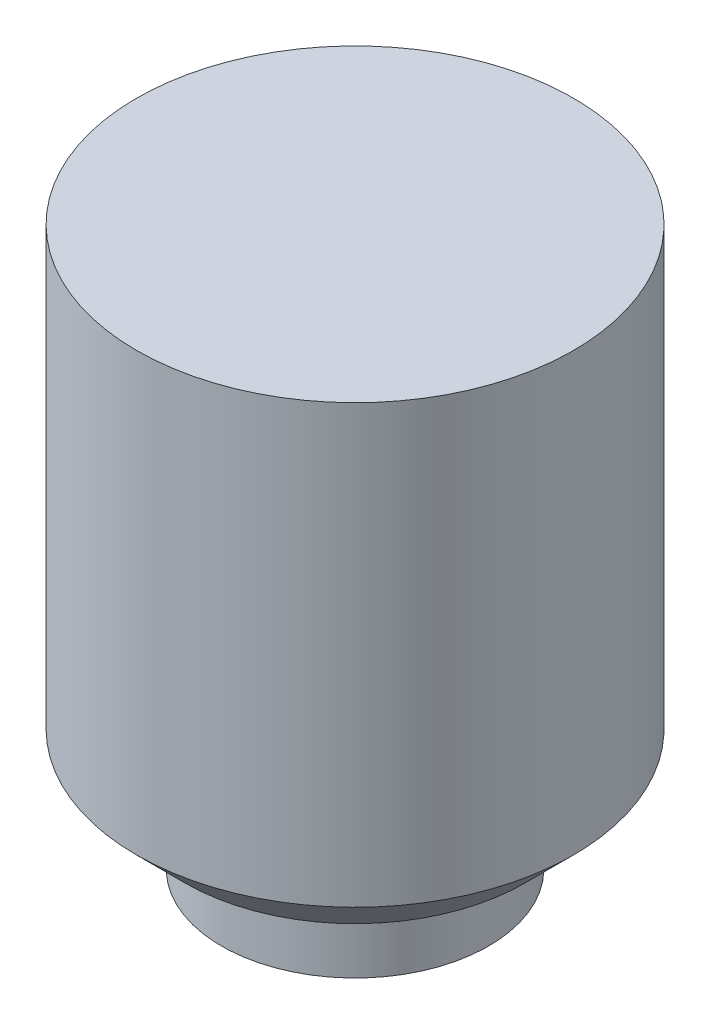
ISO-10303-21;
HEADER;
FILE_DESCRIPTION(('STEP AP214'),'2;1');
FILE_NAME('part.step','',(''),(''),'','','');
FILE_SCHEMA(('AUTOMOTIVE_DESIGN { 1 0 10303 214 1 1 1 1 }'));
ENDSEC;
DATA;
#1=APPLICATION_CONTEXT('core data for automotive mechanical design processes');
#2=APPLICATION_PROTOCOL_DEFINITION('international standard','automotive_design',2000,#1);
#3=PRODUCT_CONTEXT('',#1,'mechanical');
#4=PRODUCT('Part','Part','',(#3));
#5=PRODUCT_RELATED_PRODUCT_CATEGORY('part','',(#4));
#6=PRODUCT_DEFINITION_FORMATION('','',#4);
#7=PRODUCT_DEFINITION_CONTEXT('part definition',#1,'design');
#8=PRODUCT_DEFINITION('design','',#6,#7);
#9=PRODUCT_DEFINITION_SHAPE('','',#8);
#10=(LENGTH_UNIT() NAMED_UNIT(*) SI_UNIT(.MILLI.,.METRE.));
#11=(NAMED_UNIT(*) PLANE_ANGLE_UNIT() SI_UNIT($,.RADIAN.));
#12=(NAMED_UNIT(*) SI_UNIT($,.STERADIAN.) SOLID_ANGLE_UNIT());
#13=UNCERTAINTY_MEASURE_WITH_UNIT(LENGTH_MEASURE(1.E-05),#10,'distance_accuracy_value','');
#14=(GEOMETRIC_REPRESENTATION_CONTEXT(3) GLOBAL_UNCERTAINTY_ASSIGNED_CONTEXT((#13)) GLOBAL_UNIT_ASSIGNED_CONTEXT((#10,
#11,#12)) REPRESENTATION_CONTEXT('',''));
#15=CARTESIAN_POINT('',(0.,0.,0.));
#16=DIRECTION('',(0.,0.,1.));
#17=DIRECTION('',(1.,0.,0.));
#18=AXIS2_PLACEMENT_3D('',#15,#16,#17);
#19=CARTESIAN_POINT('',(0.,10.,0.));
#20=DIRECTION('',(0.,-1.,0.));
#21=DIRECTION('',(0.,0.,-1.));
#22=AXIS2_PLACEMENT_3D('',#19,#20,#21);
#23=CYLINDRICAL_SURFACE('',#22,4.5);
#24=CARTESIAN_POINT('',(0.,0.999999999999999,0.));
#25=DIRECTION('',(0.,1.,0.));
#26=DIRECTION('',(0.,0.,1.));
#27=AXIS2_PLACEMENT_3D('',#24,#25,#26);
#28=CIRCLE('',#27,4.5);
#29=CARTESIAN_POINT('',(0.,0.999999999999999,4.5));
#30=VERTEX_POINT('',#29);
#31=EDGE_CURVE('E47',#30,#30,#28,.T.);
#32=ORIENTED_EDGE('',*,*,#31,.T.);
#33=EDGE_LOOP('',(#32));
#34=FACE_BOUND('',#33,.T.);
#35=CARTESIAN_POINT('',(0.,10.,0.));
#36=DIRECTION('',(0.,1.,0.));
#37=DIRECTION('',(0.,0.,1.));
#38=AXIS2_PLACEMENT_3D('',#35,#36,#37);
#39=CIRCLE('',#38,4.5);
#40=CARTESIAN_POINT('',(0.,10.,4.5));
#41=VERTEX_POINT('',#40);
#42=EDGE_CURVE('E70',#41,#41,#39,.T.);
#43=ORIENTED_EDGE('',*,*,#42,.F.);
#44=EDGE_LOOP('',(#43));
#45=FACE_BOUND('',#44,.T.);
#46=ADVANCED_FACE('F39',(#34,#45),#23,.T.);
#47=CARTESIAN_POINT('',(0.,10.,0.));
#48=DIRECTION('',(0.,1.,0.));
#49=DIRECTION('',(0.,0.,1.));
#50=AXIS2_PLACEMENT_3D('',#47,#48,#49);
#51=PLANE('',#50);
#52=ORIENTED_EDGE('',*,*,#42,.T.);
#53=EDGE_LOOP('',(#52));
#54=FACE_BOUND('',#53,.T.);
#55=ADVANCED_FACE('F116',(#54),#51,.T.);
#56=CARTESIAN_POINT('',(0.,0.,0.));
#57=DIRECTION('',(0.,1.,0.));
#58=DIRECTION('',(0.,0.,1.));
#59=AXIS2_PLACEMENT_3D('',#56,#57,#58);
#60=PLANE('',#59);
#61=CARTESIAN_POINT('',(0.,0.,0.));
#62=DIRECTION('',(0.,1.,0.));
#63=DIRECTION('',(0.,0.,1.));
#64=AXIS2_PLACEMENT_3D('',#61,#62,#63);
#65=CIRCLE('',#64,3.5);
#66=CARTESIAN_POINT('',(0.,0.,3.5));
#67=VERTEX_POINT('',#66);
#68=EDGE_CURVE('E11',#67,#67,#65,.F.);
#69=ORIENTED_EDGE('',*,*,#68,.T.);
#70=EDGE_LOOP('',(#69));
#71=FACE_BOUND('',#70,.T.);
#72=CARTESIAN_POINT('',(0.,0.,0.));
#73=DIRECTION('',(0.,-1.,0.));
#74=DIRECTION('',(0.,0.,-1.));
#75=AXIS2_PLACEMENT_3D('',#72,#73,#74);
#76=CIRCLE('',#75,2.75);
#77=CARTESIAN_POINT('',(0.,0.,-2.75));
#78=VERTEX_POINT('',#77);
#79=EDGE_CURVE('E91',#78,#78,#76,.T.);
#80=ORIENTED_EDGE('',*,*,#79,.F.);
#81=EDGE_LOOP('',(#80));
#82=FACE_BOUND('',#81,.T.);
#83=ADVANCED_FACE('F120',(#71,#82),#60,.F.);
#84=CARTESIAN_POINT('',(0.,-1.5,0.));
#85=DIRECTION('',(0.,-1.,0.));
#86=DIRECTION('',(0.,0.,-1.));
#87=AXIS2_PLACEMENT_3D('',#84,#85,#86);
#88=PLANE('',#87);
#89=CARTESIAN_POINT('',(0.,-1.5,0.));
#90=DIRECTION('',(0.,-1.,0.));
#91=DIRECTION('',(0.,0.,-1.));
#92=AXIS2_PLACEMENT_3D('',#89,#90,#91);
#93=CIRCLE('',#92,2.75);
#94=CARTESIAN_POINT('',(0.,-1.5,-2.75));
#95=VERTEX_POINT('',#94);
#96=EDGE_CURVE('E80',#95,#95,#93,.T.);
#97=ORIENTED_EDGE('',*,*,#96,.T.);
#98=EDGE_LOOP('',(#97));
#99=FACE_BOUND('',#98,.T.);
#100=CARTESIAN_POINT('',(0.,-1.5,0.));
#101=DIRECTION('',(0.,-1.,0.));
#102=DIRECTION('',(0.,0.,-1.));
#103=AXIS2_PLACEMENT_3D('',#100,#101,#102);
#104=CIRCLE('',#103,1.75);
#105=CARTESIAN_POINT('',(0.,-1.5,-1.75));
#106=VERTEX_POINT('',#105);
#107=EDGE_CURVE('E83',#106,#106,#104,.T.);
#108=ORIENTED_EDGE('',*,*,#107,.F.);
#109=EDGE_LOOP('',(#108));
#110=FACE_BOUND('',#109,.T.);
#111=ADVANCED_FACE('F126',(#99,#110),#88,.T.);
#112=CARTESIAN_POINT('',(0.,-1.5,0.));
#113=DIRECTION('',(0.,1.,0.));
#114=DIRECTION('',(0.,0.,1.));
#115=AXIS2_PLACEMENT_3D('',#112,#113,#114);
#116=CYLINDRICAL_SURFACE('',#115,2.75);
#117=ORIENTED_EDGE('',*,*,#96,.F.);
#118=EDGE_LOOP('',(#117));
#119=FACE_BOUND('',#118,.T.);
#120=ORIENTED_EDGE('',*,*,#79,.T.);
#121=EDGE_LOOP('',(#120));
#122=FACE_BOUND('',#121,.T.);
#123=ADVANCED_FACE('F110',(#119,#122),#116,.T.);
#124=CARTESIAN_POINT('',(0.,-1.5,0.));
#125=DIRECTION('',(0.,1.,0.));
#126=DIRECTION('',(0.,0.,1.));
#127=AXIS2_PLACEMENT_3D('',#124,#125,#126);
#128=CYLINDRICAL_SURFACE('',#127,1.75);
#129=ORIENTED_EDGE('',*,*,#107,.T.);
#130=EDGE_LOOP('',(#129));
#131=FACE_BOUND('',#130,.T.);
#132=CARTESIAN_POINT('',(0.,0.,0.));
#133=DIRECTION('',(0.,-1.,0.));
#134=DIRECTION('',(0.,0.,-1.));
#135=AXIS2_PLACEMENT_3D('',#132,#133,#134);
#136=CIRCLE('',#135,1.75);
#137=CARTESIAN_POINT('',(0.,0.,-1.75));
#138=VERTEX_POINT('',#137);
#139=EDGE_CURVE('E217',#138,#138,#136,.T.);
#140=ORIENTED_EDGE('',*,*,#139,.F.);
#141=EDGE_LOOP('',(#140));
#142=FACE_BOUND('',#141,.T.);
#143=ADVANCED_FACE('F103',(#131,#142),#128,.F.);
#144=CARTESIAN_POINT('',(0.,3.,0.));
#145=DIRECTION('',(0.,-1.,0.));
#146=DIRECTION('',(0.,0.,-1.));
#147=AXIS2_PLACEMENT_3D('',#144,#145,#146);
#148=PLANE('',#147);
#149=CARTESIAN_POINT('',(0.,3.,0.));
#150=DIRECTION('',(0.,-1.,0.));
#151=DIRECTION('',(0.,0.,-1.));
#152=AXIS2_PLACEMENT_3D('',#149,#150,#151);
#153=CIRCLE('',#152,1.45);
#154=CARTESIAN_POINT('',(-1.,3.,1.05));
#155=VERTEX_POINT('',#154);
#156=CARTESIAN_POINT('',(1.,3.,1.05));
#157=VERTEX_POINT('',#156);
#158=EDGE_CURVE('E68',#155,#157,#153,.T.);
#159=ORIENTED_EDGE('',*,*,#158,.T.);
#160=DIRECTION('',(-1.,0.,0.));
#161=VECTOR('',#160,1.);
#162=CARTESIAN_POINT('',(-1.,3.,1.05));
#163=LINE('',#162,#161);
#164=EDGE_CURVE('E86',#157,#155,#163,.T.);
#165=ORIENTED_EDGE('',*,*,#164,.T.);
#166=EDGE_LOOP('',(#159,#165));
#167=FACE_BOUND('',#166,.T.);
#168=ADVANCED_FACE('F101',(#167),#148,.T.);
#169=CARTESIAN_POINT('',(0.,3.,0.));
#170=DIRECTION('',(0.,-1.,0.));
#171=DIRECTION('',(0.,0.,-1.));
#172=AXIS2_PLACEMENT_3D('',#169,#170,#171);
#173=CYLINDRICAL_SURFACE('',#172,1.45);
#174=CARTESIAN_POINT('',(0.,0.,0.));
#175=DIRECTION('',(0.,-1.,0.));
#176=DIRECTION('',(0.,0.,-1.));
#177=AXIS2_PLACEMENT_3D('',#174,#175,#176);
#178=CIRCLE('',#177,1.45);
#179=CARTESIAN_POINT('',(-1.,0.,1.05));
#180=VERTEX_POINT('',#179);
#181=CARTESIAN_POINT('',(1.,0.,1.05));
#182=VERTEX_POINT('',#181);
#183=EDGE_CURVE('E54',#180,#182,#178,.T.);
#184=ORIENTED_EDGE('',*,*,#183,.T.);
#185=DIRECTION('',(0.,-1.,0.));
#186=VECTOR('',#185,1.);
#187=CARTESIAN_POINT('',(1.,3.,1.05));
#188=LINE('',#187,#186);
#189=EDGE_CURVE('E71',#157,#182,#188,.T.);
#190=ORIENTED_EDGE('',*,*,#189,.F.);
#191=ORIENTED_EDGE('',*,*,#158,.F.);
#192=DIRECTION('',(0.,-1.,0.));
#193=VECTOR('',#192,1.);
#194=CARTESIAN_POINT('',(-1.,3.,1.05));
#195=LINE('',#194,#193);
#196=EDGE_CURVE('E62',#155,#180,#195,.T.);
#197=ORIENTED_EDGE('',*,*,#196,.T.);
#198=EDGE_LOOP('',(#184,#190,#191,#197));
#199=FACE_BOUND('',#198,.T.);
#200=ADVANCED_FACE('F66',(#199),#173,.F.);
#201=CARTESIAN_POINT('',(-1.,3.,1.05));
#202=DIRECTION('',(0.,0.,1.));
#203=DIRECTION('',(1.,0.,0.));
#204=AXIS2_PLACEMENT_3D('',#201,#202,#203);
#205=PLANE('',#204);
#206=DIRECTION('',(-1.,0.,0.));
#207=VECTOR('',#206,1.);
#208=CARTESIAN_POINT('',(-1.,0.,1.05));
#209=LINE('',#208,#207);
#210=EDGE_CURVE('E74',#182,#180,#209,.T.);
#211=ORIENTED_EDGE('',*,*,#210,.T.);
#212=ORIENTED_EDGE('',*,*,#196,.F.);
#213=ORIENTED_EDGE('',*,*,#164,.F.);
#214=ORIENTED_EDGE('',*,*,#189,.T.);
#215=EDGE_LOOP('',(#211,#212,#213,#214));
#216=FACE_BOUND('',#215,.T.);
#217=ADVANCED_FACE('F75',(#216),#205,.F.);
#218=ORIENTED_EDGE('',*,*,#210,.F.);
#219=ORIENTED_EDGE('',*,*,#183,.F.);
#220=EDGE_LOOP('',(#218,#219));
#221=FACE_BOUND('',#220,.T.);
#222=ORIENTED_EDGE('',*,*,#139,.T.);
#223=EDGE_LOOP('',(#222));
#224=FACE_BOUND('',#223,.T.);
#225=ADVANCED_FACE('F78',(#221,#224),#60,.F.);
#226=CARTESIAN_POINT('',(0.,0.999999999999999,0.));
#227=DIRECTION('',(0.,1.,0.));
#228=DIRECTION('',(0.,0.,1.));
#229=AXIS2_PLACEMENT_3D('',#226,#227,#228);
#230=CONICAL_SURFACE('',#229,4.5,0.78539816339745);
#231=ORIENTED_EDGE('',*,*,#68,.F.);
#232=EDGE_LOOP('',(#231));
#233=FACE_BOUND('',#232,.T.);
#234=ORIENTED_EDGE('',*,*,#31,.F.);
#235=EDGE_LOOP('',(#234));
#236=FACE_BOUND('',#235,.T.);
#237=ADVANCED_FACE('F41',(#233,#236),#230,.T.);
#238=CLOSED_SHELL('',(#46,#55,#83,#111,#123,#143,#168,#200,#217,#225,#237));
#239=MANIFOLD_SOLID_BREP('B2',#238);
#240=ADVANCED_BREP_SHAPE_REPRESENTATION('',(#18,#239),#14);
#241=SHAPE_DEFINITION_REPRESENTATION(#9,#240);
ENDSEC;
END-ISO-10303-21;
